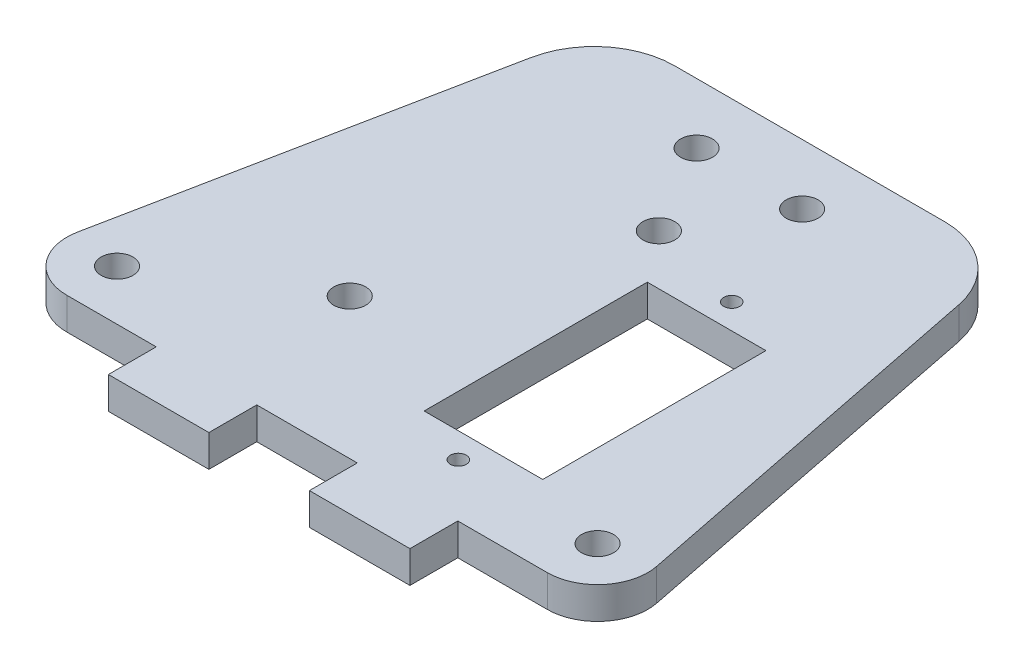
ISO-10303-21;
HEADER;
FILE_DESCRIPTION(('STEP AP214'),'2;1');
FILE_NAME('part.step','',(''),(''),'','','');
FILE_SCHEMA(('AUTOMOTIVE_DESIGN { 1 0 10303 214 1 1 1 1 }'));
ENDSEC;
DATA;
#1=APPLICATION_CONTEXT('core data for automotive mechanical design processes');
#2=APPLICATION_PROTOCOL_DEFINITION('international standard','automotive_design',2000,#1);
#3=PRODUCT_CONTEXT('',#1,'mechanical');
#4=PRODUCT('Part','Part','',(#3));
#5=PRODUCT_RELATED_PRODUCT_CATEGORY('part','',(#4));
#6=PRODUCT_DEFINITION_FORMATION('','',#4);
#7=PRODUCT_DEFINITION_CONTEXT('part definition',#1,'design');
#8=PRODUCT_DEFINITION('design','',#6,#7);
#9=PRODUCT_DEFINITION_SHAPE('','',#8);
#10=(LENGTH_UNIT() NAMED_UNIT(*) SI_UNIT(.MILLI.,.METRE.));
#11=(NAMED_UNIT(*) PLANE_ANGLE_UNIT() SI_UNIT($,.RADIAN.));
#12=(NAMED_UNIT(*) SI_UNIT($,.STERADIAN.) SOLID_ANGLE_UNIT());
#13=UNCERTAINTY_MEASURE_WITH_UNIT(LENGTH_MEASURE(1.E-05),#10,'distance_accuracy_value','');
#14=(GEOMETRIC_REPRESENTATION_CONTEXT(3) GLOBAL_UNCERTAINTY_ASSIGNED_CONTEXT((#13)) GLOBAL_UNIT_ASSIGNED_CONTEXT((#10,
#11,#12)) REPRESENTATION_CONTEXT('',''));
#15=CARTESIAN_POINT('',(0.,0.,0.));
#16=DIRECTION('',(0.,0.,1.));
#17=DIRECTION('',(1.,0.,0.));
#18=AXIS2_PLACEMENT_3D('',#15,#16,#17);
#19=CARTESIAN_POINT('',(0.,3.175,0.));
#20=DIRECTION('',(0.,0.,-1.));
#21=DIRECTION('',(-1.,0.,0.));
#22=AXIS2_PLACEMENT_3D('',#19,#20,#21);
#23=PLANE('',#22);
#24=DIRECTION('',(1.,0.,0.));
#25=VECTOR('',#24,1.);
#26=CARTESIAN_POINT('',(0.,0.,0.));
#27=LINE('',#26,#25);
#28=CARTESIAN_POINT('',(25.0000000000002,0.,0.));
#29=VERTEX_POINT('',#28);
#30=CARTESIAN_POINT('',(35.0000000000002,0.,0.));
#31=VERTEX_POINT('',#30);
#32=EDGE_CURVE('E368',#29,#31,#27,.T.);
#33=ORIENTED_EDGE('',*,*,#32,.T.);
#34=DIRECTION('',(0.,1.,0.));
#35=VECTOR('',#34,1.);
#36=CARTESIAN_POINT('',(35.0000000000002,0.,0.));
#37=LINE('',#36,#35);
#38=CARTESIAN_POINT('',(35.0000000000002,3.175,0.));
#39=VERTEX_POINT('',#38);
#40=EDGE_CURVE('E60',#31,#39,#37,.T.);
#41=ORIENTED_EDGE('',*,*,#40,.T.);
#42=DIRECTION('',(1.,0.,0.));
#43=VECTOR('',#42,1.);
#44=CARTESIAN_POINT('',(0.,3.175,0.));
#45=LINE('',#44,#43);
#46=CARTESIAN_POINT('',(25.0000000000002,3.175,0.));
#47=VERTEX_POINT('',#46);
#48=EDGE_CURVE('E353',#47,#39,#45,.T.);
#49=ORIENTED_EDGE('',*,*,#48,.F.);
#50=DIRECTION('',(0.,1.,0.));
#51=VECTOR('',#50,1.);
#52=CARTESIAN_POINT('',(25.0000000000002,0.,0.));
#53=LINE('',#52,#51);
#54=EDGE_CURVE('E233',#29,#47,#53,.T.);
#55=ORIENTED_EDGE('',*,*,#54,.F.);
#56=EDGE_LOOP('',(#33,#41,#49,#55));
#57=FACE_BOUND('',#56,.T.);
#58=ADVANCED_FACE('F37',(#57),#23,.F.);
#59=CARTESIAN_POINT('',(6.09901951359281,0.,0.));
#60=VERTEX_POINT('',#59);
#61=CARTESIAN_POINT('',(15.0000000000002,0.,0.));
#62=VERTEX_POINT('',#61);
#63=EDGE_CURVE('E366',#60,#62,#27,.T.);
#64=ORIENTED_EDGE('',*,*,#63,.T.);
#65=DIRECTION('',(0.,1.,0.));
#66=VECTOR('',#65,1.);
#67=CARTESIAN_POINT('',(15.0000000000002,0.,0.));
#68=LINE('',#67,#66);
#69=CARTESIAN_POINT('',(15.0000000000002,3.175,0.));
#70=VERTEX_POINT('',#69);
#71=EDGE_CURVE('E230',#62,#70,#68,.T.);
#72=ORIENTED_EDGE('',*,*,#71,.T.);
#73=CARTESIAN_POINT('',(6.09901951359281,3.175,0.));
#74=VERTEX_POINT('',#73);
#75=EDGE_CURVE('E349',#74,#70,#45,.T.);
#76=ORIENTED_EDGE('',*,*,#75,.F.);
#77=DIRECTION('',(0.,1.,0.));
#78=VECTOR('',#77,1.);
#79=CARTESIAN_POINT('',(6.09901951359281,0.,0.));
#80=LINE('',#79,#78);
#81=EDGE_CURVE('E254',#60,#74,#80,.T.);
#82=ORIENTED_EDGE('',*,*,#81,.F.);
#83=EDGE_LOOP('',(#64,#72,#76,#82));
#84=FACE_BOUND('',#83,.T.);
#85=ADVANCED_FACE('F423',(#84),#23,.F.);
#86=CARTESIAN_POINT('',(45.0000000000002,3.175,0.));
#87=VERTEX_POINT('',#86);
#88=CARTESIAN_POINT('',(53.9009804864072,3.175,0.));
#89=VERTEX_POINT('',#88);
#90=EDGE_CURVE('E52',#87,#89,#45,.T.);
#91=ORIENTED_EDGE('',*,*,#90,.F.);
#92=DIRECTION('',(0.,1.,0.));
#93=VECTOR('',#92,1.);
#94=CARTESIAN_POINT('',(45.0000000000002,0.,0.));
#95=LINE('',#94,#93);
#96=CARTESIAN_POINT('',(45.0000000000002,0.,0.));
#97=VERTEX_POINT('',#96);
#98=EDGE_CURVE('E209',#97,#87,#95,.T.);
#99=ORIENTED_EDGE('',*,*,#98,.F.);
#100=CARTESIAN_POINT('',(53.9009804864072,0.,0.));
#101=VERTEX_POINT('',#100);
#102=EDGE_CURVE('E365',#97,#101,#27,.T.);
#103=ORIENTED_EDGE('',*,*,#102,.T.);
#104=DIRECTION('',(0.,1.,0.));
#105=VECTOR('',#104,1.);
#106=CARTESIAN_POINT('',(53.9009804864072,0.,0.));
#107=LINE('',#106,#105);
#108=EDGE_CURVE('E242',#101,#89,#107,.T.);
#109=ORIENTED_EDGE('',*,*,#108,.T.);
#110=EDGE_LOOP('',(#91,#99,#103,#109));
#111=FACE_BOUND('',#110,.T.);
#112=ADVANCED_FACE('F439',(#111),#23,.F.);
#113=CARTESIAN_POINT('',(8.71378581622126,3.175,-43.5689290811055));
#114=DIRECTION('',(0.980580675690919,0.,0.196116135138188));
#115=DIRECTION('',(0.196116135138188,0.,-0.98058067569092));
#116=AXIS2_PLACEMENT_3D('',#113,#114,#115);
#117=PLANE('',#116);
#118=DIRECTION('',(0.,1.,0.));
#119=VECTOR('',#118,1.);
#120=CARTESIAN_POINT('',(1.19611613513821,0.,-5.98058067569094));
#121=LINE('',#120,#119);
#122=CARTESIAN_POINT('',(1.19611613513821,0.,-5.98058067569094));
#123=VERTEX_POINT('',#122);
#124=CARTESIAN_POINT('',(1.19611613513821,3.175,-5.98058067569094));
#125=VERTEX_POINT('',#124);
#126=EDGE_CURVE('E252',#123,#125,#121,.T.);
#127=ORIENTED_EDGE('',*,*,#126,.T.);
#128=DIRECTION('',(-0.196116135138188,0.,0.980580675690919));
#129=VECTOR('',#128,1.);
#130=CARTESIAN_POINT('',(8.71378581622126,3.175,-43.5689290811055));
#131=LINE('',#130,#129);
#132=CARTESIAN_POINT('',(8.71378581622126,3.175,-43.5689290811055));
#133=VERTEX_POINT('',#132);
#134=EDGE_CURVE('E346',#133,#125,#131,.T.);
#135=ORIENTED_EDGE('',*,*,#134,.F.);
#136=DIRECTION('',(0.,-1.,0.));
#137=VECTOR('',#136,1.);
#138=CARTESIAN_POINT('',(8.71378581622126,3.175,-43.5689290811055));
#139=LINE('',#138,#137);
#140=CARTESIAN_POINT('',(8.71378581622126,0.,-43.5689290811055));
#141=VERTEX_POINT('',#140);
#142=EDGE_CURVE('E372',#133,#141,#139,.T.);
#143=ORIENTED_EDGE('',*,*,#142,.T.);
#144=DIRECTION('',(-0.196116135138188,0.,0.980580675690919));
#145=VECTOR('',#144,1.);
#146=CARTESIAN_POINT('',(8.71378581622126,0.,-43.5689290811055));
#147=LINE('',#146,#145);
#148=EDGE_CURVE('E362',#141,#123,#147,.T.);
#149=ORIENTED_EDGE('',*,*,#148,.T.);
#150=EDGE_LOOP('',(#127,#135,#143,#149));
#151=FACE_BOUND('',#150,.T.);
#152=ADVANCED_FACE('F386',(#151),#117,.F.);
#153=CARTESIAN_POINT('',(43.4415687782517,3.175,-42.));
#154=DIRECTION('',(0.,1.,0.));
#155=DIRECTION('',(0.,0.,1.));
#156=AXIS2_PLACEMENT_3D('',#153,#154,#155);
#157=PLANE('',#156);
#158=CARTESIAN_POINT('',(53.9009804864072,3.175,-5.));
#159=DIRECTION('',(0.,-1.,0.));
#160=DIRECTION('',(0.,0.,1.));
#161=AXIS2_PLACEMENT_3D('',#158,#159,#160);
#162=CIRCLE('',#161,5.);
#163=CARTESIAN_POINT('',(58.8038838648618,3.175,-5.9805806756909));
#164=VERTEX_POINT('',#163);
#165=EDGE_CURVE('E232',#164,#89,#162,.T.);
#166=ORIENTED_EDGE('',*,*,#165,.F.);
#167=DIRECTION('',(-0.19611613513818,0.,-0.980580675690921));
#168=VECTOR('',#167,1.);
#169=CARTESIAN_POINT('',(51.2862141837791,3.175,-43.5689290811054));
#170=LINE('',#169,#168);
#171=CARTESIAN_POINT('',(51.2862141837791,3.175,-43.5689290811054));
#172=VERTEX_POINT('',#171);
#173=EDGE_CURVE('E352',#164,#172,#170,.T.);
#174=ORIENTED_EDGE('',*,*,#173,.T.);
#175=CARTESIAN_POINT('',(43.4415687782517,3.175,-42.));
#176=DIRECTION('',(0.,1.,0.));
#177=DIRECTION('',(0.,0.,1.));
#178=AXIS2_PLACEMENT_3D('',#175,#176,#177);
#179=CIRCLE('',#178,8.);
#180=CARTESIAN_POINT('',(43.4415687782517,3.175,-50.));
#181=VERTEX_POINT('',#180);
#182=EDGE_CURVE('E338',#172,#181,#179,.T.);
#183=ORIENTED_EDGE('',*,*,#182,.T.);
#184=DIRECTION('',(-1.,0.,0.));
#185=VECTOR('',#184,1.);
#186=CARTESIAN_POINT('',(16.5584312217487,3.175,-50.));
#187=LINE('',#186,#185);
#188=CARTESIAN_POINT('',(16.5584312217487,3.175,-50.));
#189=VERTEX_POINT('',#188);
#190=EDGE_CURVE('E341',#181,#189,#187,.T.);
#191=ORIENTED_EDGE('',*,*,#190,.T.);
#192=CARTESIAN_POINT('',(16.5584312217486,3.175,-42.));
#193=DIRECTION('',(0.,1.,0.));
#194=DIRECTION('',(0.,0.,-1.));
#195=AXIS2_PLACEMENT_3D('',#192,#193,#194);
#196=CIRCLE('',#195,8.);
#197=EDGE_CURVE('E344',#189,#133,#196,.T.);
#198=ORIENTED_EDGE('',*,*,#197,.T.);
#199=ORIENTED_EDGE('',*,*,#134,.T.);
#200=CARTESIAN_POINT('',(6.09901951359281,3.175,-5.));
#201=DIRECTION('',(0.,-1.,0.));
#202=DIRECTION('',(0.,0.,1.));
#203=AXIS2_PLACEMENT_3D('',#200,#201,#202);
#204=CIRCLE('',#203,5.);
#205=EDGE_CURVE('E247',#74,#125,#204,.T.);
#206=ORIENTED_EDGE('',*,*,#205,.F.);
#207=ORIENTED_EDGE('',*,*,#75,.T.);
#208=DIRECTION('',(0.,0.,1.));
#209=VECTOR('',#208,1.);
#210=CARTESIAN_POINT('',(15.0000000000002,3.175,0.));
#211=LINE('',#210,#209);
#212=CARTESIAN_POINT('',(15.0000000000002,3.175,4.7625));
#213=VERTEX_POINT('',#212);
#214=EDGE_CURVE('E208',#70,#213,#211,.T.);
#215=ORIENTED_EDGE('',*,*,#214,.T.);
#216=DIRECTION('',(1.,0.,0.));
#217=VECTOR('',#216,1.);
#218=CARTESIAN_POINT('',(15.0000000000002,3.175,4.7625));
#219=LINE('',#218,#217);
#220=CARTESIAN_POINT('',(25.0000000000002,3.175,4.7625));
#221=VERTEX_POINT('',#220);
#222=EDGE_CURVE('E225',#213,#221,#219,.T.);
#223=ORIENTED_EDGE('',*,*,#222,.T.);
#224=DIRECTION('',(0.,0.,-1.));
#225=VECTOR('',#224,1.);
#226=CARTESIAN_POINT('',(25.0000000000002,3.175,0.));
#227=LINE('',#226,#225);
#228=EDGE_CURVE('E216',#221,#47,#227,.T.);
#229=ORIENTED_EDGE('',*,*,#228,.T.);
#230=ORIENTED_EDGE('',*,*,#48,.T.);
#231=DIRECTION('',(0.,0.,1.));
#232=VECTOR('',#231,1.);
#233=CARTESIAN_POINT('',(35.0000000000002,3.175,0.));
#234=LINE('',#233,#232);
#235=CARTESIAN_POINT('',(35.0000000000002,3.175,4.7625));
#236=VERTEX_POINT('',#235);
#237=EDGE_CURVE('E204',#39,#236,#234,.T.);
#238=ORIENTED_EDGE('',*,*,#237,.T.);
#239=DIRECTION('',(1.,0.,0.));
#240=VECTOR('',#239,1.);
#241=CARTESIAN_POINT('',(35.0000000000002,3.175,4.7625));
#242=LINE('',#241,#240);
#243=CARTESIAN_POINT('',(45.0000000000002,3.175,4.7625));
#244=VERTEX_POINT('',#243);
#245=EDGE_CURVE('E180',#236,#244,#242,.T.);
#246=ORIENTED_EDGE('',*,*,#245,.T.);
#247=DIRECTION('',(0.,0.,-1.));
#248=VECTOR('',#247,1.);
#249=CARTESIAN_POINT('',(45.0000000000002,3.175,0.));
#250=LINE('',#249,#248);
#251=EDGE_CURVE('E198',#244,#87,#250,.T.);
#252=ORIENTED_EDGE('',*,*,#251,.T.);
#253=ORIENTED_EDGE('',*,*,#90,.T.);
#254=EDGE_LOOP('',(#166,#174,#183,#191,#198,#199,#206,#207,#215,#223,#229,#230,#238,#246,#252,#253));
#255=FACE_BOUND('',#254,.T.);
#256=CARTESIAN_POINT('',(53.9009804864072,3.175,-5.));
#257=DIRECTION('',(0.,1.,0.));
#258=DIRECTION('',(0.,0.,1.));
#259=AXIS2_PLACEMENT_3D('',#256,#257,#258);
#260=CIRCLE('',#259,1.5875);
#261=CARTESIAN_POINT('',(53.9009804864072,3.175,-3.4125));
#262=VERTEX_POINT('',#261);
#263=EDGE_CURVE('E256',#262,#262,#260,.T.);
#264=ORIENTED_EDGE('',*,*,#263,.F.);
#265=EDGE_LOOP('',(#264));
#266=FACE_BOUND('',#265,.T.);
#267=CARTESIAN_POINT('',(6.09901951359281,3.175,-5.));
#268=DIRECTION('',(0.,1.,0.));
#269=DIRECTION('',(0.,0.,1.));
#270=AXIS2_PLACEMENT_3D('',#267,#268,#269);
#271=CIRCLE('',#270,1.5875);
#272=CARTESIAN_POINT('',(6.09901951359281,3.175,-3.4125));
#273=VERTEX_POINT('',#272);
#274=EDGE_CURVE('E262',#273,#273,#271,.T.);
#275=ORIENTED_EDGE('',*,*,#274,.F.);
#276=EDGE_LOOP('',(#275));
#277=FACE_BOUND('',#276,.T.);
#278=CARTESIAN_POINT('',(30.,3.175,-35.));
#279=DIRECTION('',(0.,1.,0.));
#280=DIRECTION('',(0.,0.,1.));
#281=AXIS2_PLACEMENT_3D('',#278,#279,#280);
#282=CIRCLE('',#281,1.5875);
#283=CARTESIAN_POINT('',(30.,3.175,-33.4125));
#284=VERTEX_POINT('',#283);
#285=EDGE_CURVE('E268',#284,#284,#282,.T.);
#286=ORIENTED_EDGE('',*,*,#285,.F.);
#287=EDGE_LOOP('',(#286));
#288=FACE_BOUND('',#287,.T.);
#289=CARTESIAN_POINT('',(24.75,3.175,-44.));
#290=DIRECTION('',(0.,1.,0.));
#291=DIRECTION('',(0.,0.,1.));
#292=AXIS2_PLACEMENT_3D('',#289,#290,#291);
#293=CIRCLE('',#292,1.5875);
#294=CARTESIAN_POINT('',(24.75,3.175,-42.4125));
#295=VERTEX_POINT('',#294);
#296=EDGE_CURVE('E283',#295,#295,#293,.T.);
#297=ORIENTED_EDGE('',*,*,#296,.F.);
#298=EDGE_LOOP('',(#297));
#299=FACE_BOUND('',#298,.T.);
#300=CARTESIAN_POINT('',(39.75,3.175,-32.5));
#301=DIRECTION('',(0.,1.,0.));
#302=DIRECTION('',(0.,0.,1.));
#303=AXIS2_PLACEMENT_3D('',#300,#301,#302);
#304=CIRCLE('',#303,0.793749999999999);
#305=CARTESIAN_POINT('',(39.75,3.175,-31.70625));
#306=VERTEX_POINT('',#305);
#307=EDGE_CURVE('E295',#306,#306,#304,.T.);
#308=ORIENTED_EDGE('',*,*,#307,.F.);
#309=EDGE_LOOP('',(#308));
#310=FACE_BOUND('',#309,.T.);
#311=DIRECTION('',(1.,0.,0.));
#312=VECTOR('',#311,1.);
#313=CARTESIAN_POINT('',(45.65,3.175,-7.79999999999999));
#314=LINE('',#313,#312);
#315=CARTESIAN_POINT('',(33.85,3.175,-7.79999999999999));
#316=VERTEX_POINT('',#315);
#317=CARTESIAN_POINT('',(45.65,3.175,-7.79999999999999));
#318=VERTEX_POINT('',#317);
#319=EDGE_CURVE('E309',#316,#318,#314,.T.);
#320=ORIENTED_EDGE('',*,*,#319,.F.);
#321=DIRECTION('',(0.,0.,1.));
#322=VECTOR('',#321,1.);
#323=CARTESIAN_POINT('',(33.85,3.175,-30.));
#324=LINE('',#323,#322);
#325=CARTESIAN_POINT('',(33.85,3.175,-30.));
#326=VERTEX_POINT('',#325);
#327=EDGE_CURVE('E307',#326,#316,#324,.T.);
#328=ORIENTED_EDGE('',*,*,#327,.F.);
#329=DIRECTION('',(-1.,0.,0.));
#330=VECTOR('',#329,1.);
#331=CARTESIAN_POINT('',(33.85,3.175,-30.));
#332=LINE('',#331,#330);
#333=CARTESIAN_POINT('',(45.65,3.175,-30.));
#334=VERTEX_POINT('',#333);
#335=EDGE_CURVE('E315',#334,#326,#332,.T.);
#336=ORIENTED_EDGE('',*,*,#335,.F.);
#337=DIRECTION('',(0.,0.,-1.));
#338=VECTOR('',#337,1.);
#339=CARTESIAN_POINT('',(45.65,3.175,-30.));
#340=LINE('',#339,#338);
#341=EDGE_CURVE('E312',#318,#334,#340,.T.);
#342=ORIENTED_EDGE('',*,*,#341,.F.);
#343=EDGE_LOOP('',(#320,#328,#336,#342));
#344=FACE_BOUND('',#343,.T.);
#345=CARTESIAN_POINT('',(39.75,3.175,-5.29999999999999));
#346=DIRECTION('',(0.,1.,0.));
#347=DIRECTION('',(0.,0.,1.));
#348=AXIS2_PLACEMENT_3D('',#345,#346,#347);
#349=CIRCLE('',#348,0.79375);
#350=CARTESIAN_POINT('',(39.75,3.175,-4.50624999999999));
#351=VERTEX_POINT('',#350);
#352=EDGE_CURVE('E301',#351,#351,#349,.T.);
#353=ORIENTED_EDGE('',*,*,#352,.F.);
#354=EDGE_LOOP('',(#353));
#355=FACE_BOUND('',#354,.T.);
#356=CARTESIAN_POINT('',(20.25,3.175,-14.));
#357=DIRECTION('',(0.,1.,0.));
#358=DIRECTION('',(0.,0.,1.));
#359=AXIS2_PLACEMENT_3D('',#356,#357,#358);
#360=CIRCLE('',#359,1.5875);
#361=CARTESIAN_POINT('',(20.25,3.175,-12.4125));
#362=VERTEX_POINT('',#361);
#363=EDGE_CURVE('E289',#362,#362,#360,.T.);
#364=ORIENTED_EDGE('',*,*,#363,.F.);
#365=EDGE_LOOP('',(#364));
#366=FACE_BOUND('',#365,.T.);
#367=CARTESIAN_POINT('',(35.25,3.175,-44.));
#368=DIRECTION('',(0.,1.,0.));
#369=DIRECTION('',(0.,0.,1.));
#370=AXIS2_PLACEMENT_3D('',#367,#368,#369);
#371=CIRCLE('',#370,1.5875);
#372=CARTESIAN_POINT('',(35.25,3.175,-42.4125));
#373=VERTEX_POINT('',#372);
#374=EDGE_CURVE('E277',#373,#373,#371,.T.);
#375=ORIENTED_EDGE('',*,*,#374,.F.);
#376=EDGE_LOOP('',(#375));
#377=FACE_BOUND('',#376,.T.);
#378=ADVANCED_FACE('F391',(#255,#266,#277,#288,#299,#310,#344,#355,#366,#377),#157,.T.);
#379=CARTESIAN_POINT('',(43.4415687782517,0.,-42.));
#380=DIRECTION('',(0.,1.,0.));
#381=DIRECTION('',(0.,0.,1.));
#382=AXIS2_PLACEMENT_3D('',#379,#380,#381);
#383=PLANE('',#382);
#384=CARTESIAN_POINT('',(53.9009804864072,0.,-5.));
#385=DIRECTION('',(0.,1.,0.));
#386=DIRECTION('',(0.,0.,1.));
#387=AXIS2_PLACEMENT_3D('',#384,#385,#386);
#388=CIRCLE('',#387,1.5875);
#389=CARTESIAN_POINT('',(53.9009804864072,0.,-3.4125));
#390=VERTEX_POINT('',#389);
#391=EDGE_CURVE('E259',#390,#390,#388,.T.);
#392=ORIENTED_EDGE('',*,*,#391,.T.);
#393=EDGE_LOOP('',(#392));
#394=FACE_BOUND('',#393,.T.);
#395=CARTESIAN_POINT('',(6.09901951359281,0.,-5.));
#396=DIRECTION('',(0.,1.,0.));
#397=DIRECTION('',(0.,0.,1.));
#398=AXIS2_PLACEMENT_3D('',#395,#396,#397);
#399=CIRCLE('',#398,1.5875);
#400=CARTESIAN_POINT('',(6.09901951359281,0.,-3.4125));
#401=VERTEX_POINT('',#400);
#402=EDGE_CURVE('E265',#401,#401,#399,.T.);
#403=ORIENTED_EDGE('',*,*,#402,.T.);
#404=EDGE_LOOP('',(#403));
#405=FACE_BOUND('',#404,.T.);
#406=CARTESIAN_POINT('',(30.,0.,-35.));
#407=DIRECTION('',(0.,1.,0.));
#408=DIRECTION('',(0.,0.,1.));
#409=AXIS2_PLACEMENT_3D('',#406,#407,#408);
#410=CIRCLE('',#409,1.5875);
#411=CARTESIAN_POINT('',(30.,0.,-33.4125));
#412=VERTEX_POINT('',#411);
#413=EDGE_CURVE('E271',#412,#412,#410,.T.);
#414=ORIENTED_EDGE('',*,*,#413,.T.);
#415=EDGE_LOOP('',(#414));
#416=FACE_BOUND('',#415,.T.);
#417=CARTESIAN_POINT('',(24.75,0.,-44.));
#418=DIRECTION('',(0.,1.,0.));
#419=DIRECTION('',(0.,0.,1.));
#420=AXIS2_PLACEMENT_3D('',#417,#418,#419);
#421=CIRCLE('',#420,1.5875);
#422=CARTESIAN_POINT('',(24.75,0.,-42.4125));
#423=VERTEX_POINT('',#422);
#424=EDGE_CURVE('E280',#423,#423,#421,.T.);
#425=ORIENTED_EDGE('',*,*,#424,.T.);
#426=EDGE_LOOP('',(#425));
#427=FACE_BOUND('',#426,.T.);
#428=CARTESIAN_POINT('',(39.75,0.,-32.5));
#429=DIRECTION('',(0.,1.,0.));
#430=DIRECTION('',(0.,0.,1.));
#431=AXIS2_PLACEMENT_3D('',#428,#429,#430);
#432=CIRCLE('',#431,0.793749999999999);
#433=CARTESIAN_POINT('',(39.75,0.,-31.70625));
#434=VERTEX_POINT('',#433);
#435=EDGE_CURVE('E292',#434,#434,#432,.T.);
#436=ORIENTED_EDGE('',*,*,#435,.T.);
#437=EDGE_LOOP('',(#436));
#438=FACE_BOUND('',#437,.T.);
#439=DIRECTION('',(0.,0.,1.));
#440=VECTOR('',#439,1.);
#441=CARTESIAN_POINT('',(33.85,0.,-30.));
#442=LINE('',#441,#440);
#443=CARTESIAN_POINT('',(33.85,0.,-30.));
#444=VERTEX_POINT('',#443);
#445=CARTESIAN_POINT('',(33.85,0.,-7.79999999999999));
#446=VERTEX_POINT('',#445);
#447=EDGE_CURVE('E304',#444,#446,#442,.T.);
#448=ORIENTED_EDGE('',*,*,#447,.T.);
#449=DIRECTION('',(1.,0.,0.));
#450=VECTOR('',#449,1.);
#451=CARTESIAN_POINT('',(45.65,0.,-7.79999999999999));
#452=LINE('',#451,#450);
#453=CARTESIAN_POINT('',(45.65,0.,-7.79999999999999));
#454=VERTEX_POINT('',#453);
#455=EDGE_CURVE('E320',#446,#454,#452,.T.);
#456=ORIENTED_EDGE('',*,*,#455,.T.);
#457=DIRECTION('',(0.,0.,-1.));
#458=VECTOR('',#457,1.);
#459=CARTESIAN_POINT('',(45.65,0.,-30.));
#460=LINE('',#459,#458);
#461=CARTESIAN_POINT('',(45.65,0.,-30.));
#462=VERTEX_POINT('',#461);
#463=EDGE_CURVE('E323',#454,#462,#460,.T.);
#464=ORIENTED_EDGE('',*,*,#463,.T.);
#465=DIRECTION('',(-1.,0.,0.));
#466=VECTOR('',#465,1.);
#467=CARTESIAN_POINT('',(33.85,0.,-30.));
#468=LINE('',#467,#466);
#469=EDGE_CURVE('E310',#462,#444,#468,.T.);
#470=ORIENTED_EDGE('',*,*,#469,.T.);
#471=EDGE_LOOP('',(#448,#456,#464,#470));
#472=FACE_BOUND('',#471,.T.);
#473=DIRECTION('',(-0.19611613513818,0.,-0.980580675690921));
#474=VECTOR('',#473,1.);
#475=CARTESIAN_POINT('',(51.2862141837791,0.,-43.5689290811054));
#476=LINE('',#475,#474);
#477=CARTESIAN_POINT('',(58.8038838648618,0.,-5.98058067569091));
#478=VERTEX_POINT('',#477);
#479=CARTESIAN_POINT('',(51.2862141837791,0.,-43.5689290811054));
#480=VERTEX_POINT('',#479);
#481=EDGE_CURVE('E342',#478,#480,#476,.T.);
#482=ORIENTED_EDGE('',*,*,#481,.F.);
#483=CARTESIAN_POINT('',(53.9009804864072,0.,-5.));
#484=DIRECTION('',(0.,-1.,0.));
#485=DIRECTION('',(0.,0.,1.));
#486=AXIS2_PLACEMENT_3D('',#483,#484,#485);
#487=CIRCLE('',#486,5.);
#488=EDGE_CURVE('E239',#478,#101,#487,.T.);
#489=ORIENTED_EDGE('',*,*,#488,.T.);
#490=ORIENTED_EDGE('',*,*,#102,.F.);
#491=DIRECTION('',(0.,0.,-1.));
#492=VECTOR('',#491,1.);
#493=CARTESIAN_POINT('',(45.0000000000002,0.,0.));
#494=LINE('',#493,#492);
#495=CARTESIAN_POINT('',(45.0000000000002,0.,4.7625));
#496=VERTEX_POINT('',#495);
#497=EDGE_CURVE('E186',#496,#97,#494,.T.);
#498=ORIENTED_EDGE('',*,*,#497,.F.);
#499=DIRECTION('',(1.,0.,0.));
#500=VECTOR('',#499,1.);
#501=CARTESIAN_POINT('',(35.0000000000002,0.,4.7625));
#502=LINE('',#501,#500);
#503=CARTESIAN_POINT('',(35.0000000000002,0.,4.7625));
#504=VERTEX_POINT('',#503);
#505=EDGE_CURVE('E178',#504,#496,#502,.T.);
#506=ORIENTED_EDGE('',*,*,#505,.F.);
#507=DIRECTION('',(0.,0.,1.));
#508=VECTOR('',#507,1.);
#509=CARTESIAN_POINT('',(35.0000000000002,0.,0.));
#510=LINE('',#509,#508);
#511=EDGE_CURVE('E194',#31,#504,#510,.T.);
#512=ORIENTED_EDGE('',*,*,#511,.F.);
#513=ORIENTED_EDGE('',*,*,#32,.F.);
#514=DIRECTION('',(0.,0.,-1.));
#515=VECTOR('',#514,1.);
#516=CARTESIAN_POINT('',(25.0000000000002,0.,0.));
#517=LINE('',#516,#515);
#518=CARTESIAN_POINT('',(25.0000000000002,0.,4.7625));
#519=VERTEX_POINT('',#518);
#520=EDGE_CURVE('E219',#519,#29,#517,.T.);
#521=ORIENTED_EDGE('',*,*,#520,.F.);
#522=DIRECTION('',(1.,0.,0.));
#523=VECTOR('',#522,1.);
#524=CARTESIAN_POINT('',(15.0000000000002,0.,4.7625));
#525=LINE('',#524,#523);
#526=CARTESIAN_POINT('',(15.0000000000002,0.,4.7625));
#527=VERTEX_POINT('',#526);
#528=EDGE_CURVE('E215',#527,#519,#525,.T.);
#529=ORIENTED_EDGE('',*,*,#528,.F.);
#530=DIRECTION('',(0.,0.,1.));
#531=VECTOR('',#530,1.);
#532=CARTESIAN_POINT('',(15.0000000000002,0.,0.));
#533=LINE('',#532,#531);
#534=EDGE_CURVE('E212',#62,#527,#533,.T.);
#535=ORIENTED_EDGE('',*,*,#534,.F.);
#536=ORIENTED_EDGE('',*,*,#63,.F.);
#537=CARTESIAN_POINT('',(6.09901951359281,0.,-5.));
#538=DIRECTION('',(0.,-1.,0.));
#539=DIRECTION('',(0.,0.,1.));
#540=AXIS2_PLACEMENT_3D('',#537,#538,#539);
#541=CIRCLE('',#540,5.);
#542=EDGE_CURVE('E249',#60,#123,#541,.T.);
#543=ORIENTED_EDGE('',*,*,#542,.T.);
#544=ORIENTED_EDGE('',*,*,#148,.F.);
#545=CARTESIAN_POINT('',(16.5584312217486,0.,-42.));
#546=DIRECTION('',(0.,1.,0.));
#547=DIRECTION('',(0.,0.,-1.));
#548=AXIS2_PLACEMENT_3D('',#545,#546,#547);
#549=CIRCLE('',#548,8.);
#550=CARTESIAN_POINT('',(16.5584312217487,0.,-50.));
#551=VERTEX_POINT('',#550);
#552=EDGE_CURVE('E360',#551,#141,#549,.T.);
#553=ORIENTED_EDGE('',*,*,#552,.F.);
#554=DIRECTION('',(-1.,0.,0.));
#555=VECTOR('',#554,1.);
#556=CARTESIAN_POINT('',(16.5584312217487,0.,-50.));
#557=LINE('',#556,#555);
#558=CARTESIAN_POINT('',(43.4415687782517,0.,-50.));
#559=VERTEX_POINT('',#558);
#560=EDGE_CURVE('E358',#559,#551,#557,.T.);
#561=ORIENTED_EDGE('',*,*,#560,.F.);
#562=CARTESIAN_POINT('',(43.4415687782517,0.,-42.));
#563=DIRECTION('',(0.,1.,0.));
#564=DIRECTION('',(0.,0.,1.));
#565=AXIS2_PLACEMENT_3D('',#562,#563,#564);
#566=CIRCLE('',#565,8.);
#567=EDGE_CURVE('E337',#480,#559,#566,.T.);
#568=ORIENTED_EDGE('',*,*,#567,.F.);
#569=EDGE_LOOP('',(#482,#489,#490,#498,#506,#512,#513,#521,#529,#535,#536,#543,#544,#553,#561,#568));
#570=FACE_BOUND('',#569,.T.);
#571=CARTESIAN_POINT('',(39.75,0.,-5.29999999999999));
#572=DIRECTION('',(0.,1.,0.));
#573=DIRECTION('',(0.,0.,1.));
#574=AXIS2_PLACEMENT_3D('',#571,#572,#573);
#575=CIRCLE('',#574,0.79375);
#576=CARTESIAN_POINT('',(39.75,0.,-4.50624999999999));
#577=VERTEX_POINT('',#576);
#578=EDGE_CURVE('E298',#577,#577,#575,.T.);
#579=ORIENTED_EDGE('',*,*,#578,.T.);
#580=EDGE_LOOP('',(#579));
#581=FACE_BOUND('',#580,.T.);
#582=CARTESIAN_POINT('',(20.25,0.,-14.));
#583=DIRECTION('',(0.,1.,0.));
#584=DIRECTION('',(0.,0.,1.));
#585=AXIS2_PLACEMENT_3D('',#582,#583,#584);
#586=CIRCLE('',#585,1.5875);
#587=CARTESIAN_POINT('',(20.25,0.,-12.4125));
#588=VERTEX_POINT('',#587);
#589=EDGE_CURVE('E286',#588,#588,#586,.T.);
#590=ORIENTED_EDGE('',*,*,#589,.T.);
#591=EDGE_LOOP('',(#590));
#592=FACE_BOUND('',#591,.T.);
#593=CARTESIAN_POINT('',(35.25,0.,-44.));
#594=DIRECTION('',(0.,1.,0.));
#595=DIRECTION('',(0.,0.,1.));
#596=AXIS2_PLACEMENT_3D('',#593,#594,#595);
#597=CIRCLE('',#596,1.5875);
#598=CARTESIAN_POINT('',(35.25,0.,-42.4125));
#599=VERTEX_POINT('',#598);
#600=EDGE_CURVE('E274',#599,#599,#597,.T.);
#601=ORIENTED_EDGE('',*,*,#600,.T.);
#602=EDGE_LOOP('',(#601));
#603=FACE_BOUND('',#602,.T.);
#604=ADVANCED_FACE('F192',(#394,#405,#416,#427,#438,#472,#570,#581,#592,#603),#383,.F.);
#605=CARTESIAN_POINT('',(43.4415687782517,3.175,-42.));
#606=DIRECTION('',(0.,-1.,0.));
#607=DIRECTION('',(0.,0.,-1.));
#608=AXIS2_PLACEMENT_3D('',#605,#606,#607);
#609=CYLINDRICAL_SURFACE('',#608,8.);
#610=ORIENTED_EDGE('',*,*,#567,.T.);
#611=DIRECTION('',(0.,-1.,0.));
#612=VECTOR('',#611,1.);
#613=CARTESIAN_POINT('',(43.4415687782517,3.175,-50.));
#614=LINE('',#613,#612);
#615=EDGE_CURVE('E11',#181,#559,#614,.T.);
#616=ORIENTED_EDGE('',*,*,#615,.F.);
#617=ORIENTED_EDGE('',*,*,#182,.F.);
#618=DIRECTION('',(0.,-1.,0.));
#619=VECTOR('',#618,1.);
#620=CARTESIAN_POINT('',(51.2862141837791,3.175,-43.5689290811054));
#621=LINE('',#620,#619);
#622=EDGE_CURVE('E355',#172,#480,#621,.T.);
#623=ORIENTED_EDGE('',*,*,#622,.T.);
#624=EDGE_LOOP('',(#610,#616,#617,#623));
#625=FACE_BOUND('',#624,.T.);
#626=ADVANCED_FACE('F39',(#625),#609,.T.);
#627=CARTESIAN_POINT('',(16.5584312217487,3.175,-50.));
#628=DIRECTION('',(0.,0.,1.));
#629=DIRECTION('',(1.,0.,0.));
#630=AXIS2_PLACEMENT_3D('',#627,#628,#629);
#631=PLANE('',#630);
#632=ORIENTED_EDGE('',*,*,#560,.T.);
#633=DIRECTION('',(0.,-1.,0.));
#634=VECTOR('',#633,1.);
#635=CARTESIAN_POINT('',(16.5584312217487,3.175,-50.));
#636=LINE('',#635,#634);
#637=EDGE_CURVE('E45',#189,#551,#636,.T.);
#638=ORIENTED_EDGE('',*,*,#637,.F.);
#639=ORIENTED_EDGE('',*,*,#190,.F.);
#640=ORIENTED_EDGE('',*,*,#615,.T.);
#641=EDGE_LOOP('',(#632,#638,#639,#640));
#642=FACE_BOUND('',#641,.T.);
#643=ADVANCED_FACE('F396',(#642),#631,.F.);
#644=CARTESIAN_POINT('',(16.5584312217486,3.175,-42.));
#645=DIRECTION('',(0.,-1.,0.));
#646=DIRECTION('',(0.,0.,-1.));
#647=AXIS2_PLACEMENT_3D('',#644,#645,#646);
#648=CYLINDRICAL_SURFACE('',#647,8.);
#649=ORIENTED_EDGE('',*,*,#552,.T.);
#650=ORIENTED_EDGE('',*,*,#142,.F.);
#651=ORIENTED_EDGE('',*,*,#197,.F.);
#652=ORIENTED_EDGE('',*,*,#637,.T.);
#653=EDGE_LOOP('',(#649,#650,#651,#652));
#654=FACE_BOUND('',#653,.T.);
#655=ADVANCED_FACE('F379',(#654),#648,.T.);
#656=CARTESIAN_POINT('',(51.2862141837791,3.175,-43.5689290811054));
#657=DIRECTION('',(-0.980580675690921,0.,0.19611613513818));
#658=DIRECTION('',(0.19611613513818,0.,0.980580675690921));
#659=AXIS2_PLACEMENT_3D('',#656,#657,#658);
#660=PLANE('',#659);
#661=ORIENTED_EDGE('',*,*,#173,.F.);
#662=DIRECTION('',(0.,1.,0.));
#663=VECTOR('',#662,1.);
#664=CARTESIAN_POINT('',(58.8038838648618,0.,-5.9805806756909));
#665=LINE('',#664,#663);
#666=EDGE_CURVE('E245',#478,#164,#665,.T.);
#667=ORIENTED_EDGE('',*,*,#666,.F.);
#668=ORIENTED_EDGE('',*,*,#481,.T.);
#669=ORIENTED_EDGE('',*,*,#622,.F.);
#670=EDGE_LOOP('',(#661,#667,#668,#669));
#671=FACE_BOUND('',#670,.T.);
#672=ADVANCED_FACE('F402',(#671),#660,.F.);
#673=CARTESIAN_POINT('',(33.85,3.175,-30.));
#674=DIRECTION('',(1.,0.,0.));
#675=DIRECTION('',(0.,0.,-1.));
#676=AXIS2_PLACEMENT_3D('',#673,#674,#675);
#677=PLANE('',#676);
#678=ORIENTED_EDGE('',*,*,#447,.F.);
#679=DIRECTION('',(0.,-1.,0.));
#680=VECTOR('',#679,1.);
#681=CARTESIAN_POINT('',(33.85,3.175,-30.));
#682=LINE('',#681,#680);
#683=EDGE_CURVE('E317',#326,#444,#682,.T.);
#684=ORIENTED_EDGE('',*,*,#683,.F.);
#685=ORIENTED_EDGE('',*,*,#327,.T.);
#686=DIRECTION('',(0.,-1.,0.));
#687=VECTOR('',#686,1.);
#688=CARTESIAN_POINT('',(33.85,3.175,-7.79999999999999));
#689=LINE('',#688,#687);
#690=EDGE_CURVE('E334',#316,#446,#689,.T.);
#691=ORIENTED_EDGE('',*,*,#690,.T.);
#692=EDGE_LOOP('',(#678,#684,#685,#691));
#693=FACE_BOUND('',#692,.T.);
#694=ADVANCED_FACE('F469',(#693),#677,.T.);
#695=CARTESIAN_POINT('',(45.65,3.175,-7.79999999999999));
#696=DIRECTION('',(0.,0.,-1.));
#697=DIRECTION('',(-1.,0.,0.));
#698=AXIS2_PLACEMENT_3D('',#695,#696,#697);
#699=PLANE('',#698);
#700=ORIENTED_EDGE('',*,*,#455,.F.);
#701=ORIENTED_EDGE('',*,*,#690,.F.);
#702=ORIENTED_EDGE('',*,*,#319,.T.);
#703=DIRECTION('',(0.,-1.,0.));
#704=VECTOR('',#703,1.);
#705=CARTESIAN_POINT('',(45.65,3.175,-7.79999999999999));
#706=LINE('',#705,#704);
#707=EDGE_CURVE('E332',#318,#454,#706,.T.);
#708=ORIENTED_EDGE('',*,*,#707,.T.);
#709=EDGE_LOOP('',(#700,#701,#702,#708));
#710=FACE_BOUND('',#709,.T.);
#711=ADVANCED_FACE('F473',(#710),#699,.T.);
#712=CARTESIAN_POINT('',(45.65,3.175,-30.));
#713=DIRECTION('',(-1.,0.,0.));
#714=DIRECTION('',(0.,0.,1.));
#715=AXIS2_PLACEMENT_3D('',#712,#713,#714);
#716=PLANE('',#715);
#717=ORIENTED_EDGE('',*,*,#463,.F.);
#718=ORIENTED_EDGE('',*,*,#707,.F.);
#719=ORIENTED_EDGE('',*,*,#341,.T.);
#720=DIRECTION('',(0.,-1.,0.));
#721=VECTOR('',#720,1.);
#722=CARTESIAN_POINT('',(45.65,3.175,-30.));
#723=LINE('',#722,#721);
#724=EDGE_CURVE('E330',#334,#462,#723,.T.);
#725=ORIENTED_EDGE('',*,*,#724,.T.);
#726=EDGE_LOOP('',(#717,#718,#719,#725));
#727=FACE_BOUND('',#726,.T.);
#728=ADVANCED_FACE('F478',(#727),#716,.T.);
#729=CARTESIAN_POINT('',(33.85,3.175,-30.));
#730=DIRECTION('',(0.,0.,1.));
#731=DIRECTION('',(1.,0.,0.));
#732=AXIS2_PLACEMENT_3D('',#729,#730,#731);
#733=PLANE('',#732);
#734=ORIENTED_EDGE('',*,*,#469,.F.);
#735=ORIENTED_EDGE('',*,*,#724,.F.);
#736=ORIENTED_EDGE('',*,*,#335,.T.);
#737=ORIENTED_EDGE('',*,*,#683,.T.);
#738=EDGE_LOOP('',(#734,#735,#736,#737));
#739=FACE_BOUND('',#738,.T.);
#740=ADVANCED_FACE('F484',(#739),#733,.T.);
#741=CARTESIAN_POINT('',(39.75,3.175,-5.29999999999999));
#742=DIRECTION('',(0.,-1.,0.));
#743=DIRECTION('',(0.,0.,-1.));
#744=AXIS2_PLACEMENT_3D('',#741,#742,#743);
#745=CYLINDRICAL_SURFACE('',#744,0.79375);
#746=ORIENTED_EDGE('',*,*,#352,.T.);
#747=EDGE_LOOP('',(#746));
#748=FACE_BOUND('',#747,.T.);
#749=ORIENTED_EDGE('',*,*,#578,.F.);
#750=EDGE_LOOP('',(#749));
#751=FACE_BOUND('',#750,.T.);
#752=ADVANCED_FACE('F488',(#748,#751),#745,.F.);
#753=CARTESIAN_POINT('',(39.75,3.175,-32.5));
#754=DIRECTION('',(0.,-1.,0.));
#755=DIRECTION('',(0.,0.,-1.));
#756=AXIS2_PLACEMENT_3D('',#753,#754,#755);
#757=CYLINDRICAL_SURFACE('',#756,0.793749999999999);
#758=ORIENTED_EDGE('',*,*,#307,.T.);
#759=EDGE_LOOP('',(#758));
#760=FACE_BOUND('',#759,.T.);
#761=ORIENTED_EDGE('',*,*,#435,.F.);
#762=EDGE_LOOP('',(#761));
#763=FACE_BOUND('',#762,.T.);
#764=ADVANCED_FACE('F492',(#760,#763),#757,.F.);
#765=CARTESIAN_POINT('',(20.25,3.175,-14.));
#766=DIRECTION('',(0.,-1.,0.));
#767=DIRECTION('',(0.,0.,-1.));
#768=AXIS2_PLACEMENT_3D('',#765,#766,#767);
#769=CYLINDRICAL_SURFACE('',#768,1.5875);
#770=ORIENTED_EDGE('',*,*,#363,.T.);
#771=EDGE_LOOP('',(#770));
#772=FACE_BOUND('',#771,.T.);
#773=ORIENTED_EDGE('',*,*,#589,.F.);
#774=EDGE_LOOP('',(#773));
#775=FACE_BOUND('',#774,.T.);
#776=ADVANCED_FACE('F496',(#772,#775),#769,.F.);
#777=CARTESIAN_POINT('',(24.75,3.175,-44.));
#778=DIRECTION('',(0.,-1.,0.));
#779=DIRECTION('',(0.,0.,-1.));
#780=AXIS2_PLACEMENT_3D('',#777,#778,#779);
#781=CYLINDRICAL_SURFACE('',#780,1.5875);
#782=ORIENTED_EDGE('',*,*,#296,.T.);
#783=EDGE_LOOP('',(#782));
#784=FACE_BOUND('',#783,.T.);
#785=ORIENTED_EDGE('',*,*,#424,.F.);
#786=EDGE_LOOP('',(#785));
#787=FACE_BOUND('',#786,.T.);
#788=ADVANCED_FACE('F500',(#784,#787),#781,.F.);
#789=CARTESIAN_POINT('',(35.25,3.175,-44.));
#790=DIRECTION('',(0.,-1.,0.));
#791=DIRECTION('',(0.,0.,-1.));
#792=AXIS2_PLACEMENT_3D('',#789,#790,#791);
#793=CYLINDRICAL_SURFACE('',#792,1.5875);
#794=ORIENTED_EDGE('',*,*,#374,.T.);
#795=EDGE_LOOP('',(#794));
#796=FACE_BOUND('',#795,.T.);
#797=ORIENTED_EDGE('',*,*,#600,.F.);
#798=EDGE_LOOP('',(#797));
#799=FACE_BOUND('',#798,.T.);
#800=ADVANCED_FACE('F504',(#796,#799),#793,.F.);
#801=CARTESIAN_POINT('',(30.,0.,-35.));
#802=DIRECTION('',(0.,1.,0.));
#803=DIRECTION('',(0.,0.,1.));
#804=AXIS2_PLACEMENT_3D('',#801,#802,#803);
#805=CYLINDRICAL_SURFACE('',#804,1.5875);
#806=ORIENTED_EDGE('',*,*,#413,.F.);
#807=EDGE_LOOP('',(#806));
#808=FACE_BOUND('',#807,.T.);
#809=ORIENTED_EDGE('',*,*,#285,.T.);
#810=EDGE_LOOP('',(#809));
#811=FACE_BOUND('',#810,.T.);
#812=ADVANCED_FACE('F508',(#808,#811),#805,.F.);
#813=CARTESIAN_POINT('',(6.09901951359281,0.,-5.));
#814=DIRECTION('',(0.,1.,0.));
#815=DIRECTION('',(0.,0.,1.));
#816=AXIS2_PLACEMENT_3D('',#813,#814,#815);
#817=CYLINDRICAL_SURFACE('',#816,1.5875);
#818=ORIENTED_EDGE('',*,*,#402,.F.);
#819=EDGE_LOOP('',(#818));
#820=FACE_BOUND('',#819,.T.);
#821=ORIENTED_EDGE('',*,*,#274,.T.);
#822=EDGE_LOOP('',(#821));
#823=FACE_BOUND('',#822,.T.);
#824=ADVANCED_FACE('F434',(#820,#823),#817,.F.);
#825=CARTESIAN_POINT('',(53.9009804864072,0.,-5.));
#826=DIRECTION('',(0.,1.,0.));
#827=DIRECTION('',(0.,0.,1.));
#828=AXIS2_PLACEMENT_3D('',#825,#826,#827);
#829=CYLINDRICAL_SURFACE('',#828,1.5875);
#830=ORIENTED_EDGE('',*,*,#391,.F.);
#831=EDGE_LOOP('',(#830));
#832=FACE_BOUND('',#831,.T.);
#833=ORIENTED_EDGE('',*,*,#263,.T.);
#834=EDGE_LOOP('',(#833));
#835=FACE_BOUND('',#834,.T.);
#836=ADVANCED_FACE('F427',(#832,#835),#829,.F.);
#837=CARTESIAN_POINT('',(6.09901951359281,0.,-5.));
#838=DIRECTION('',(0.,1.,0.));
#839=DIRECTION('',(0.,0.,1.));
#840=AXIS2_PLACEMENT_3D('',#837,#838,#839);
#841=CYLINDRICAL_SURFACE('',#840,5.);
#842=ORIENTED_EDGE('',*,*,#205,.T.);
#843=ORIENTED_EDGE('',*,*,#126,.F.);
#844=ORIENTED_EDGE('',*,*,#542,.F.);
#845=ORIENTED_EDGE('',*,*,#81,.T.);
#846=EDGE_LOOP('',(#842,#843,#844,#845));
#847=FACE_BOUND('',#846,.T.);
#848=ADVANCED_FACE('F425',(#847),#841,.T.);
#849=CARTESIAN_POINT('',(53.9009804864072,0.,-5.));
#850=DIRECTION('',(0.,1.,0.));
#851=DIRECTION('',(0.,0.,1.));
#852=AXIS2_PLACEMENT_3D('',#849,#850,#851);
#853=CYLINDRICAL_SURFACE('',#852,5.);
#854=ORIENTED_EDGE('',*,*,#165,.T.);
#855=ORIENTED_EDGE('',*,*,#108,.F.);
#856=ORIENTED_EDGE('',*,*,#488,.F.);
#857=ORIENTED_EDGE('',*,*,#666,.T.);
#858=EDGE_LOOP('',(#854,#855,#856,#857));
#859=FACE_BOUND('',#858,.T.);
#860=ADVANCED_FACE('F404',(#859),#853,.T.);
#861=CARTESIAN_POINT('',(15.0000000000002,0.,0.));
#862=DIRECTION('',(-1.,0.,0.));
#863=DIRECTION('',(0.,0.,1.));
#864=AXIS2_PLACEMENT_3D('',#861,#862,#863);
#865=PLANE('',#864);
#866=ORIENTED_EDGE('',*,*,#214,.F.);
#867=ORIENTED_EDGE('',*,*,#71,.F.);
#868=ORIENTED_EDGE('',*,*,#534,.T.);
#869=DIRECTION('',(0.,1.,0.));
#870=VECTOR('',#869,1.);
#871=CARTESIAN_POINT('',(15.0000000000002,0.,4.7625));
#872=LINE('',#871,#870);
#873=EDGE_CURVE('E222',#527,#213,#872,.T.);
#874=ORIENTED_EDGE('',*,*,#873,.T.);
#875=EDGE_LOOP('',(#866,#867,#868,#874));
#876=FACE_BOUND('',#875,.T.);
#877=ADVANCED_FACE('F419',(#876),#865,.T.);
#878=CARTESIAN_POINT('',(25.0000000000002,0.,0.));
#879=DIRECTION('',(1.,0.,0.));
#880=DIRECTION('',(0.,0.,-1.));
#881=AXIS2_PLACEMENT_3D('',#878,#879,#880);
#882=PLANE('',#881);
#883=ORIENTED_EDGE('',*,*,#228,.F.);
#884=DIRECTION('',(0.,1.,0.));
#885=VECTOR('',#884,1.);
#886=CARTESIAN_POINT('',(25.0000000000002,0.,4.7625));
#887=LINE('',#886,#885);
#888=EDGE_CURVE('E236',#519,#221,#887,.T.);
#889=ORIENTED_EDGE('',*,*,#888,.F.);
#890=ORIENTED_EDGE('',*,*,#520,.T.);
#891=ORIENTED_EDGE('',*,*,#54,.T.);
#892=EDGE_LOOP('',(#883,#889,#890,#891));
#893=FACE_BOUND('',#892,.T.);
#894=ADVANCED_FACE('F410',(#893),#882,.T.);
#895=CARTESIAN_POINT('',(15.0000000000002,0.,4.7625));
#896=DIRECTION('',(0.,0.,1.));
#897=DIRECTION('',(1.,0.,0.));
#898=AXIS2_PLACEMENT_3D('',#895,#896,#897);
#899=PLANE('',#898);
#900=ORIENTED_EDGE('',*,*,#222,.F.);
#901=ORIENTED_EDGE('',*,*,#873,.F.);
#902=ORIENTED_EDGE('',*,*,#528,.T.);
#903=ORIENTED_EDGE('',*,*,#888,.T.);
#904=EDGE_LOOP('',(#900,#901,#902,#903));
#905=FACE_BOUND('',#904,.T.);
#906=ADVANCED_FACE('F416',(#905),#899,.T.);
#907=CARTESIAN_POINT('',(35.0000000000002,0.,0.));
#908=DIRECTION('',(-1.,0.,0.));
#909=DIRECTION('',(0.,0.,1.));
#910=AXIS2_PLACEMENT_3D('',#907,#908,#909);
#911=PLANE('',#910);
#912=ORIENTED_EDGE('',*,*,#237,.F.);
#913=ORIENTED_EDGE('',*,*,#40,.F.);
#914=ORIENTED_EDGE('',*,*,#511,.T.);
#915=DIRECTION('',(0.,1.,0.));
#916=VECTOR('',#915,1.);
#917=CARTESIAN_POINT('',(35.0000000000002,0.,4.7625));
#918=LINE('',#917,#916);
#919=EDGE_CURVE('E175',#504,#236,#918,.T.);
#920=ORIENTED_EDGE('',*,*,#919,.T.);
#921=EDGE_LOOP('',(#912,#913,#914,#920));
#922=FACE_BOUND('',#921,.T.);
#923=ADVANCED_FACE('F197',(#922),#911,.T.);
#924=CARTESIAN_POINT('',(45.0000000000002,0.,0.));
#925=DIRECTION('',(1.,0.,0.));
#926=DIRECTION('',(0.,0.,-1.));
#927=AXIS2_PLACEMENT_3D('',#924,#925,#926);
#928=PLANE('',#927);
#929=ORIENTED_EDGE('',*,*,#251,.F.);
#930=DIRECTION('',(0.,1.,0.));
#931=VECTOR('',#930,1.);
#932=CARTESIAN_POINT('',(45.0000000000002,0.,4.7625));
#933=LINE('',#932,#931);
#934=EDGE_CURVE('E185',#496,#244,#933,.T.);
#935=ORIENTED_EDGE('',*,*,#934,.F.);
#936=ORIENTED_EDGE('',*,*,#497,.T.);
#937=ORIENTED_EDGE('',*,*,#98,.T.);
#938=EDGE_LOOP('',(#929,#935,#936,#937));
#939=FACE_BOUND('',#938,.T.);
#940=ADVANCED_FACE('F638',(#939),#928,.T.);
#941=CARTESIAN_POINT('',(35.0000000000002,0.,4.7625));
#942=DIRECTION('',(0.,0.,1.));
#943=DIRECTION('',(1.,0.,0.));
#944=AXIS2_PLACEMENT_3D('',#941,#942,#943);
#945=PLANE('',#944);
#946=ORIENTED_EDGE('',*,*,#245,.F.);
#947=ORIENTED_EDGE('',*,*,#919,.F.);
#948=ORIENTED_EDGE('',*,*,#505,.T.);
#949=ORIENTED_EDGE('',*,*,#934,.T.);
#950=EDGE_LOOP('',(#946,#947,#948,#949));
#951=FACE_BOUND('',#950,.T.);
#952=ADVANCED_FACE('F177',(#951),#945,.T.);
#953=CLOSED_SHELL('',(#58,#85,#112,#152,#378,#604,#626,#643,#655,#672,#694,#711,#728,#740,#752,
#764,#776,#788,#800,#812,#824,#836,#848,#860,#877,#894,#906,#923,#940,#952));
#954=MANIFOLD_SOLID_BREP('B2',#953);
#955=ADVANCED_BREP_SHAPE_REPRESENTATION('',(#18,#954),#14);
#956=SHAPE_DEFINITION_REPRESENTATION(#9,#955);
ENDSEC;
END-ISO-10303-21;
